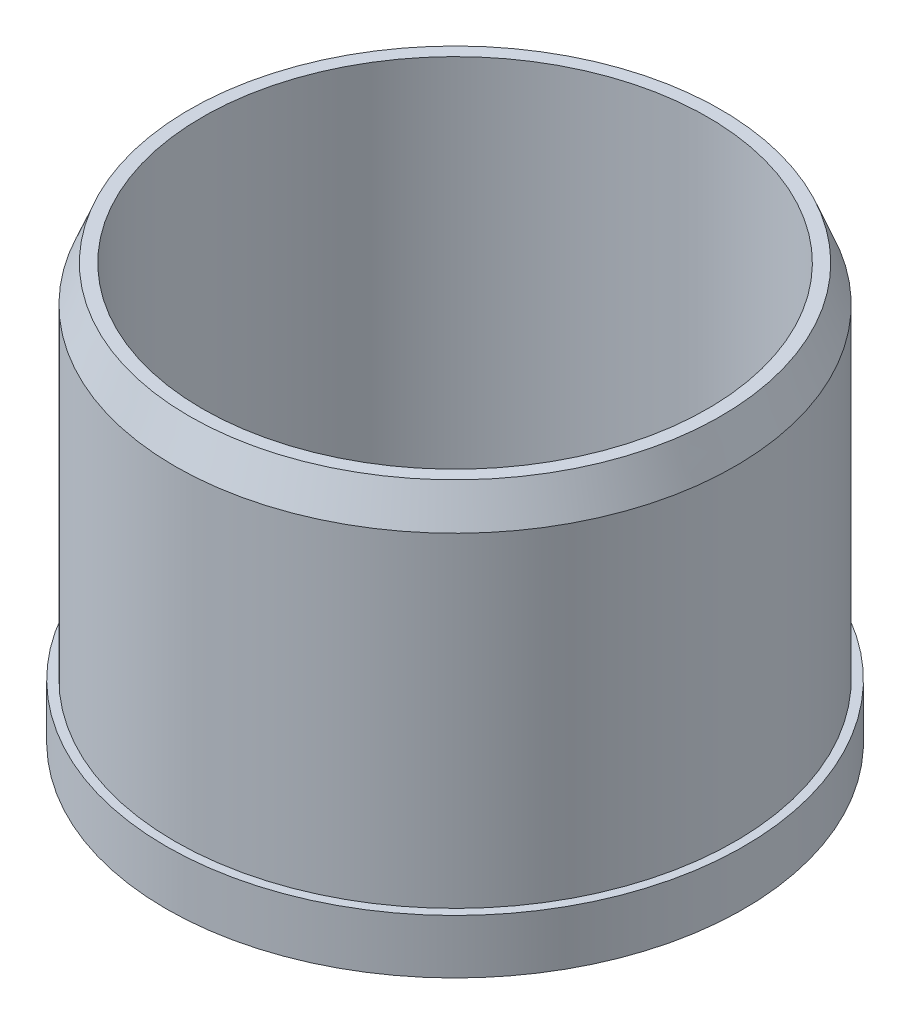
ISO-10303-21;
HEADER;
FILE_DESCRIPTION(('STEP AP214'),'2;1');
FILE_NAME('part.step','',(''),(''),'','','');
FILE_SCHEMA(('AUTOMOTIVE_DESIGN { 1 0 10303 214 1 1 1 1 }'));
ENDSEC;
DATA;
#1=APPLICATION_CONTEXT('core data for automotive mechanical design processes');
#2=APPLICATION_PROTOCOL_DEFINITION('international standard','automotive_design',2000,#1);
#3=PRODUCT_CONTEXT('',#1,'mechanical');
#4=PRODUCT('Part','Part','',(#3));
#5=PRODUCT_RELATED_PRODUCT_CATEGORY('part','',(#4));
#6=PRODUCT_DEFINITION_FORMATION('','',#4);
#7=PRODUCT_DEFINITION_CONTEXT('part definition',#1,'design');
#8=PRODUCT_DEFINITION('design','',#6,#7);
#9=PRODUCT_DEFINITION_SHAPE('','',#8);
#10=(LENGTH_UNIT() NAMED_UNIT(*) SI_UNIT(.MILLI.,.METRE.));
#11=(NAMED_UNIT(*) PLANE_ANGLE_UNIT() SI_UNIT($,.RADIAN.));
#12=(NAMED_UNIT(*) SI_UNIT($,.STERADIAN.) SOLID_ANGLE_UNIT());
#13=UNCERTAINTY_MEASURE_WITH_UNIT(LENGTH_MEASURE(1.E-05),#10,'distance_accuracy_value','');
#14=(GEOMETRIC_REPRESENTATION_CONTEXT(3) GLOBAL_UNCERTAINTY_ASSIGNED_CONTEXT((#13)) GLOBAL_UNIT_ASSIGNED_CONTEXT((#10,
#11,#12)) REPRESENTATION_CONTEXT('',''));
#15=CARTESIAN_POINT('',(0.,0.,0.));
#16=DIRECTION('',(0.,0.,1.));
#17=DIRECTION('',(1.,0.,0.));
#18=AXIS2_PLACEMENT_3D('',#15,#16,#17);
#19=CARTESIAN_POINT('',(0.,9.525,0.));
#20=DIRECTION('',(0.,1.,0.));
#21=DIRECTION('',(0.,0.,1.));
#22=AXIS2_PLACEMENT_3D('',#19,#20,#21);
#23=PLANE('',#22);
#24=CARTESIAN_POINT('',(0.,9.525,0.));
#25=DIRECTION('',(0.,1.,0.));
#26=DIRECTION('',(0.,0.,1.));
#27=AXIS2_PLACEMENT_3D('',#24,#25,#26);
#28=CIRCLE('',#27,12.7);
#29=CARTESIAN_POINT('',(0.,9.525,12.7));
#30=VERTEX_POINT('',#29);
#31=EDGE_CURVE('E107',#30,#30,#28,.T.);
#32=ORIENTED_EDGE('',*,*,#31,.F.);
#33=EDGE_LOOP('',(#32));
#34=FACE_BOUND('',#33,.T.);
#35=CARTESIAN_POINT('',(27.1764399531351,9.525,-8.83016061426567));
#36=DIRECTION('',(0.,1.,0.));
#37=DIRECTION('',(0.,0.,1.));
#38=AXIS2_PLACEMENT_3D('',#35,#36,#37);
#39=CIRCLE('',#38,12.7000000000007);
#40=CARTESIAN_POINT('',(27.1764399531351,9.525,3.86983938573504));
#41=VERTEX_POINT('',#40);
#42=EDGE_CURVE('E88',#41,#41,#39,.T.);
#43=ORIENTED_EDGE('',*,*,#42,.F.);
#44=EDGE_LOOP('',(#43));
#45=FACE_BOUND('',#44,.T.);
#46=CARTESIAN_POINT('',(16.7959635842603,9.525,23.1176606142632));
#47=DIRECTION('',(0.,1.,0.));
#48=DIRECTION('',(0.,0.,1.));
#49=AXIS2_PLACEMENT_3D('',#46,#47,#48);
#50=CIRCLE('',#49,12.7000000000027);
#51=CARTESIAN_POINT('',(16.7959635842603,9.525,35.8176606142658));
#52=VERTEX_POINT('',#51);
#53=EDGE_CURVE('E91',#52,#52,#50,.T.);
#54=ORIENTED_EDGE('',*,*,#53,.F.);
#55=EDGE_LOOP('',(#54));
#56=FACE_BOUND('',#55,.T.);
#57=CARTESIAN_POINT('',(-16.7959635842545,9.525,23.1176606142651));
#58=DIRECTION('',(0.,1.,0.));
#59=DIRECTION('',(0.,0.,1.));
#60=AXIS2_PLACEMENT_3D('',#57,#58,#59);
#61=CIRCLE('',#60,12.7000000000033);
#62=CARTESIAN_POINT('',(-16.7959635842545,9.525,35.8176606142684));
#63=VERTEX_POINT('',#62);
#64=EDGE_CURVE('E94',#63,#63,#61,.T.);
#65=ORIENTED_EDGE('',*,*,#64,.F.);
#66=EDGE_LOOP('',(#65));
#67=FACE_BOUND('',#66,.T.);
#68=CARTESIAN_POINT('',(-27.1764399531329,9.525,-8.83016061426258));
#69=DIRECTION('',(0.,1.,0.));
#70=DIRECTION('',(0.,0.,1.));
#71=AXIS2_PLACEMENT_3D('',#68,#69,#70);
#72=CIRCLE('',#71,12.7000000000018);
#73=CARTESIAN_POINT('',(-27.1764399531329,9.525,3.86983938573925));
#74=VERTEX_POINT('',#73);
#75=EDGE_CURVE('E97',#74,#74,#72,.T.);
#76=ORIENTED_EDGE('',*,*,#75,.F.);
#77=EDGE_LOOP('',(#76));
#78=FACE_BOUND('',#77,.T.);
#79=CARTESIAN_POINT('',(0.,9.525,-28.575));
#80=DIRECTION('',(0.,1.,0.));
#81=DIRECTION('',(0.,0.,1.));
#82=AXIS2_PLACEMENT_3D('',#79,#80,#81);
#83=CIRCLE('',#82,12.7);
#84=CARTESIAN_POINT('',(0.,9.525,-15.875));
#85=VERTEX_POINT('',#84);
#86=EDGE_CURVE('E65',#85,#85,#83,.T.);
#87=ORIENTED_EDGE('',*,*,#86,.F.);
#88=EDGE_LOOP('',(#87));
#89=FACE_BOUND('',#88,.T.);
#90=CARTESIAN_POINT('',(0.,9.525,0.));
#91=DIRECTION('',(0.,1.,0.));
#92=DIRECTION('',(0.,0.,1.));
#93=AXIS2_PLACEMENT_3D('',#90,#91,#92);
#94=CIRCLE('',#93,44.45);
#95=CARTESIAN_POINT('',(0.,9.525,44.45));
#96=VERTEX_POINT('',#95);
#97=EDGE_CURVE('E104',#96,#96,#94,.T.);
#98=ORIENTED_EDGE('',*,*,#97,.T.);
#99=EDGE_LOOP('',(#98));
#100=FACE_BOUND('',#99,.T.);
#101=ADVANCED_FACE('F41',(#34,#45,#56,#67,#78,#89,#100),#23,.T.);
#102=CARTESIAN_POINT('',(0.,9.525,0.));
#103=DIRECTION('',(0.,-1.,0.));
#104=DIRECTION('',(0.,0.,-1.));
#105=AXIS2_PLACEMENT_3D('',#102,#103,#104);
#106=CYLINDRICAL_SURFACE('',#105,50.8);
#107=CARTESIAN_POINT('',(0.,9.525,0.));
#108=DIRECTION('',(0.,1.,0.));
#109=DIRECTION('',(0.,0.,1.));
#110=AXIS2_PLACEMENT_3D('',#107,#108,#109);
#111=CIRCLE('',#110,50.8);
#112=CARTESIAN_POINT('',(0.,9.525,50.8));
#113=VERTEX_POINT('',#112);
#114=EDGE_CURVE('E85',#113,#113,#111,.T.);
#115=ORIENTED_EDGE('',*,*,#114,.F.);
#116=EDGE_LOOP('',(#115));
#117=FACE_BOUND('',#116,.T.);
#118=CARTESIAN_POINT('',(0.,0.,0.));
#119=DIRECTION('',(0.,1.,0.));
#120=DIRECTION('',(0.,0.,1.));
#121=AXIS2_PLACEMENT_3D('',#118,#119,#120);
#122=CIRCLE('',#121,50.8);
#123=CARTESIAN_POINT('',(0.,0.,50.8));
#124=VERTEX_POINT('',#123);
#125=EDGE_CURVE('E66',#124,#124,#122,.T.);
#126=ORIENTED_EDGE('',*,*,#125,.T.);
#127=EDGE_LOOP('',(#126));
#128=FACE_BOUND('',#127,.T.);
#129=ADVANCED_FACE('F131',(#117,#128),#106,.T.);
#130=CARTESIAN_POINT('',(27.1764399531351,9.525,-8.83016061426567));
#131=DIRECTION('',(0.,-1.,0.));
#132=DIRECTION('',(0.,0.,-1.));
#133=AXIS2_PLACEMENT_3D('',#130,#131,#132);
#134=CYLINDRICAL_SURFACE('',#133,12.7000000000007);
#135=ORIENTED_EDGE('',*,*,#42,.T.);
#136=EDGE_LOOP('',(#135));
#137=FACE_BOUND('',#136,.T.);
#138=CARTESIAN_POINT('',(27.1764399531351,0.,-8.83016061426567));
#139=DIRECTION('',(0.,1.,0.));
#140=DIRECTION('',(0.,0.,1.));
#141=AXIS2_PLACEMENT_3D('',#138,#139,#140);
#142=CIRCLE('',#141,12.7000000000007);
#143=CARTESIAN_POINT('',(27.1764399531351,0.,3.86983938573504));
#144=VERTEX_POINT('',#143);
#145=EDGE_CURVE('E69',#144,#144,#142,.T.);
#146=ORIENTED_EDGE('',*,*,#145,.F.);
#147=EDGE_LOOP('',(#146));
#148=FACE_BOUND('',#147,.T.);
#149=ADVANCED_FACE('F138',(#137,#148),#134,.F.);
#150=CARTESIAN_POINT('',(16.7959635842603,9.525,23.1176606142632));
#151=DIRECTION('',(0.,-1.,0.));
#152=DIRECTION('',(0.,0.,-1.));
#153=AXIS2_PLACEMENT_3D('',#150,#151,#152);
#154=CYLINDRICAL_SURFACE('',#153,12.7000000000027);
#155=ORIENTED_EDGE('',*,*,#53,.T.);
#156=EDGE_LOOP('',(#155));
#157=FACE_BOUND('',#156,.T.);
#158=CARTESIAN_POINT('',(16.7959635842603,0.,23.1176606142632));
#159=DIRECTION('',(0.,1.,0.));
#160=DIRECTION('',(0.,0.,1.));
#161=AXIS2_PLACEMENT_3D('',#158,#159,#160);
#162=CIRCLE('',#161,12.7000000000027);
#163=CARTESIAN_POINT('',(16.7959635842603,0.,35.8176606142658));
#164=VERTEX_POINT('',#163);
#165=EDGE_CURVE('E72',#164,#164,#162,.T.);
#166=ORIENTED_EDGE('',*,*,#165,.F.);
#167=EDGE_LOOP('',(#166));
#168=FACE_BOUND('',#167,.T.);
#169=ADVANCED_FACE('F225',(#157,#168),#154,.F.);
#170=CARTESIAN_POINT('',(-16.7959635842545,9.525,23.1176606142651));
#171=DIRECTION('',(0.,-1.,0.));
#172=DIRECTION('',(0.,0.,-1.));
#173=AXIS2_PLACEMENT_3D('',#170,#171,#172);
#174=CYLINDRICAL_SURFACE('',#173,12.7000000000033);
#175=ORIENTED_EDGE('',*,*,#64,.T.);
#176=EDGE_LOOP('',(#175));
#177=FACE_BOUND('',#176,.T.);
#178=CARTESIAN_POINT('',(-16.7959635842545,0.,23.1176606142651));
#179=DIRECTION('',(0.,1.,0.));
#180=DIRECTION('',(0.,0.,1.));
#181=AXIS2_PLACEMENT_3D('',#178,#179,#180);
#182=CIRCLE('',#181,12.7000000000033);
#183=CARTESIAN_POINT('',(-16.7959635842545,0.,35.8176606142684));
#184=VERTEX_POINT('',#183);
#185=EDGE_CURVE('E75',#184,#184,#182,.T.);
#186=ORIENTED_EDGE('',*,*,#185,.F.);
#187=EDGE_LOOP('',(#186));
#188=FACE_BOUND('',#187,.T.);
#189=ADVANCED_FACE('F217',(#177,#188),#174,.F.);
#190=CARTESIAN_POINT('',(-27.1764399531329,9.525,-8.83016061426258));
#191=DIRECTION('',(0.,-1.,0.));
#192=DIRECTION('',(0.,0.,-1.));
#193=AXIS2_PLACEMENT_3D('',#190,#191,#192);
#194=CYLINDRICAL_SURFACE('',#193,12.7000000000018);
#195=ORIENTED_EDGE('',*,*,#75,.T.);
#196=EDGE_LOOP('',(#195));
#197=FACE_BOUND('',#196,.T.);
#198=CARTESIAN_POINT('',(-27.1764399531329,0.,-8.83016061426258));
#199=DIRECTION('',(0.,1.,0.));
#200=DIRECTION('',(0.,0.,1.));
#201=AXIS2_PLACEMENT_3D('',#198,#199,#200);
#202=CIRCLE('',#201,12.7000000000018);
#203=CARTESIAN_POINT('',(-27.1764399531329,0.,3.86983938573925));
#204=VERTEX_POINT('',#203);
#205=EDGE_CURVE('E78',#204,#204,#202,.T.);
#206=ORIENTED_EDGE('',*,*,#205,.F.);
#207=EDGE_LOOP('',(#206));
#208=FACE_BOUND('',#207,.T.);
#209=ADVANCED_FACE('F208',(#197,#208),#194,.F.);
#210=CARTESIAN_POINT('',(0.,9.525,-28.575));
#211=DIRECTION('',(0.,-1.,0.));
#212=DIRECTION('',(0.,0.,-1.));
#213=AXIS2_PLACEMENT_3D('',#210,#211,#212);
#214=CYLINDRICAL_SURFACE('',#213,12.7);
#215=ORIENTED_EDGE('',*,*,#86,.T.);
#216=EDGE_LOOP('',(#215));
#217=FACE_BOUND('',#216,.T.);
#218=CARTESIAN_POINT('',(0.,0.,-28.575));
#219=DIRECTION('',(0.,1.,0.));
#220=DIRECTION('',(0.,0.,1.));
#221=AXIS2_PLACEMENT_3D('',#218,#219,#220);
#222=CIRCLE('',#221,12.7);
#223=CARTESIAN_POINT('',(0.,0.,-15.875));
#224=VERTEX_POINT('',#223);
#225=EDGE_CURVE('E81',#224,#224,#222,.T.);
#226=ORIENTED_EDGE('',*,*,#225,.F.);
#227=EDGE_LOOP('',(#226));
#228=FACE_BOUND('',#227,.T.);
#229=ADVANCED_FACE('F154',(#217,#228),#214,.F.);
#230=CARTESIAN_POINT('',(0.,9.525,0.));
#231=DIRECTION('',(0.,-1.,0.));
#232=DIRECTION('',(0.,0.,-1.));
#233=AXIS2_PLACEMENT_3D('',#230,#231,#232);
#234=CYLINDRICAL_SURFACE('',#233,6.5024);
#235=CARTESIAN_POINT('',(0.,0.,0.));
#236=DIRECTION('',(0.,1.,0.));
#237=DIRECTION('',(0.,0.,1.));
#238=AXIS2_PLACEMENT_3D('',#235,#236,#237);
#239=CIRCLE('',#238,6.5024);
#240=CARTESIAN_POINT('',(0.,0.,6.5024));
#241=VERTEX_POINT('',#240);
#242=EDGE_CURVE('E62',#241,#241,#239,.T.);
#243=ORIENTED_EDGE('',*,*,#242,.F.);
#244=EDGE_LOOP('',(#243));
#245=FACE_BOUND('',#244,.T.);
#246=CARTESIAN_POINT('',(0.,31.75,0.));
#247=DIRECTION('',(0.,1.,0.));
#248=DIRECTION('',(0.,0.,1.));
#249=AXIS2_PLACEMENT_3D('',#246,#247,#248);
#250=CIRCLE('',#249,6.5024);
#251=CARTESIAN_POINT('',(0.,31.75,6.5024));
#252=VERTEX_POINT('',#251);
#253=EDGE_CURVE('E112',#252,#252,#250,.T.);
#254=ORIENTED_EDGE('',*,*,#253,.T.);
#255=EDGE_LOOP('',(#254));
#256=FACE_BOUND('',#255,.T.);
#257=ADVANCED_FACE('F116',(#245,#256),#234,.F.);
#258=CARTESIAN_POINT('',(0.,9.525,0.));
#259=DIRECTION('',(0.,1.,0.));
#260=DIRECTION('',(0.,0.,1.));
#261=AXIS2_PLACEMENT_3D('',#258,#259,#260);
#262=CIRCLE('',#261,49.276);
#263=CARTESIAN_POINT('',(0.,9.525,49.276));
#264=VERTEX_POINT('',#263);
#265=EDGE_CURVE('E61',#264,#264,#262,.T.);
#266=ORIENTED_EDGE('',*,*,#265,.F.);
#267=EDGE_LOOP('',(#266));
#268=FACE_BOUND('',#267,.T.);
#269=ORIENTED_EDGE('',*,*,#114,.T.);
#270=EDGE_LOOP('',(#269));
#271=FACE_BOUND('',#270,.T.);
#272=ADVANCED_FACE('F134',(#268,#271),#23,.T.);
#273=CARTESIAN_POINT('',(0.,0.,0.));
#274=DIRECTION('',(0.,1.,0.));
#275=DIRECTION('',(0.,0.,1.));
#276=AXIS2_PLACEMENT_3D('',#273,#274,#275);
#277=PLANE('',#276);
#278=ORIENTED_EDGE('',*,*,#225,.T.);
#279=EDGE_LOOP('',(#278));
#280=FACE_BOUND('',#279,.T.);
#281=ORIENTED_EDGE('',*,*,#205,.T.);
#282=EDGE_LOOP('',(#281));
#283=FACE_BOUND('',#282,.T.);
#284=ORIENTED_EDGE('',*,*,#185,.T.);
#285=EDGE_LOOP('',(#284));
#286=FACE_BOUND('',#285,.T.);
#287=ORIENTED_EDGE('',*,*,#165,.T.);
#288=EDGE_LOOP('',(#287));
#289=FACE_BOUND('',#288,.T.);
#290=ORIENTED_EDGE('',*,*,#145,.T.);
#291=EDGE_LOOP('',(#290));
#292=FACE_BOUND('',#291,.T.);
#293=ORIENTED_EDGE('',*,*,#125,.F.);
#294=EDGE_LOOP('',(#293));
#295=FACE_BOUND('',#294,.T.);
#296=ORIENTED_EDGE('',*,*,#242,.T.);
#297=EDGE_LOOP('',(#296));
#298=FACE_BOUND('',#297,.T.);
#299=ADVANCED_FACE('F146',(#280,#283,#286,#289,#292,#295,#298),#277,.F.);
#300=CARTESIAN_POINT('',(0.,73.025,0.));
#301=DIRECTION('',(0.,1.,0.));
#302=DIRECTION('',(0.,0.,1.));
#303=AXIS2_PLACEMENT_3D('',#300,#301,#302);
#304=PLANE('',#303);
#305=CARTESIAN_POINT('',(0.,73.025,0.));
#306=DIRECTION('',(0.,1.,0.));
#307=DIRECTION('',(0.,0.,1.));
#308=AXIS2_PLACEMENT_3D('',#305,#306,#307);
#309=CIRCLE('',#308,46.736);
#310=CARTESIAN_POINT('',(0.,73.025,46.736));
#311=VERTEX_POINT('',#310);
#312=EDGE_CURVE('E56',#311,#311,#309,.T.);
#313=ORIENTED_EDGE('',*,*,#312,.T.);
#314=EDGE_LOOP('',(#313));
#315=FACE_BOUND('',#314,.T.);
#316=CARTESIAN_POINT('',(0.,73.025,0.));
#317=DIRECTION('',(0.,1.,0.));
#318=DIRECTION('',(0.,0.,1.));
#319=AXIS2_PLACEMENT_3D('',#316,#317,#318);
#320=CIRCLE('',#319,44.45);
#321=CARTESIAN_POINT('',(0.,73.025,44.45));
#322=VERTEX_POINT('',#321);
#323=EDGE_CURVE('E84',#322,#322,#320,.T.);
#324=ORIENTED_EDGE('',*,*,#323,.F.);
#325=EDGE_LOOP('',(#324));
#326=FACE_BOUND('',#325,.T.);
#327=ADVANCED_FACE('F152',(#315,#326),#304,.T.);
#328=CARTESIAN_POINT('',(0.,73.025,0.));
#329=DIRECTION('',(0.,-1.,0.));
#330=DIRECTION('',(0.,0.,-1.));
#331=AXIS2_PLACEMENT_3D('',#328,#329,#330);
#332=CYLINDRICAL_SURFACE('',#331,49.276);
#333=CARTESIAN_POINT('',(0.,66.675,0.));
#334=DIRECTION('',(0.,1.,0.));
#335=DIRECTION('',(0.,0.,1.));
#336=AXIS2_PLACEMENT_3D('',#333,#334,#335);
#337=CIRCLE('',#336,49.276);
#338=CARTESIAN_POINT('',(0.,66.675,49.276));
#339=VERTEX_POINT('',#338);
#340=EDGE_CURVE('E52',#339,#339,#337,.F.);
#341=ORIENTED_EDGE('',*,*,#340,.T.);
#342=EDGE_LOOP('',(#341));
#343=FACE_BOUND('',#342,.T.);
#344=ORIENTED_EDGE('',*,*,#265,.T.);
#345=EDGE_LOOP('',(#344));
#346=FACE_BOUND('',#345,.T.);
#347=ADVANCED_FACE('F166',(#343,#346),#332,.T.);
#348=CARTESIAN_POINT('',(0.,73.025,0.));
#349=DIRECTION('',(0.,-1.,0.));
#350=DIRECTION('',(0.,0.,-1.));
#351=AXIS2_PLACEMENT_3D('',#348,#349,#350);
#352=CYLINDRICAL_SURFACE('',#351,44.45);
#353=ORIENTED_EDGE('',*,*,#323,.T.);
#354=EDGE_LOOP('',(#353));
#355=FACE_BOUND('',#354,.T.);
#356=ORIENTED_EDGE('',*,*,#97,.F.);
#357=EDGE_LOOP('',(#356));
#358=FACE_BOUND('',#357,.T.);
#359=ADVANCED_FACE('F168',(#355,#358),#352,.F.);
#360=CARTESIAN_POINT('',(0.,25.4,0.));
#361=DIRECTION('',(0.,-1.,0.));
#362=DIRECTION('',(0.,0.,-1.));
#363=AXIS2_PLACEMENT_3D('',#360,#361,#362);
#364=CYLINDRICAL_SURFACE('',#363,12.7);
#365=CARTESIAN_POINT('',(0.,29.21,0.));
#366=DIRECTION('',(0.,1.,0.));
#367=DIRECTION('',(0.,0.,1.));
#368=AXIS2_PLACEMENT_3D('',#365,#366,#367);
#369=CIRCLE('',#368,12.7);
#370=CARTESIAN_POINT('',(0.,29.21,12.7));
#371=VERTEX_POINT('',#370);
#372=EDGE_CURVE('E10',#371,#371,#369,.F.);
#373=ORIENTED_EDGE('',*,*,#372,.T.);
#374=EDGE_LOOP('',(#373));
#375=FACE_BOUND('',#374,.T.);
#376=ORIENTED_EDGE('',*,*,#31,.T.);
#377=EDGE_LOOP('',(#376));
#378=FACE_BOUND('',#377,.T.);
#379=ADVANCED_FACE('F127',(#375,#378),#364,.T.);
#380=CARTESIAN_POINT('',(0.,73.025,0.));
#381=DIRECTION('',(0.,-1.,0.));
#382=DIRECTION('',(0.,0.,-1.));
#383=AXIS2_PLACEMENT_3D('',#380,#381,#382);
#384=CONICAL_SURFACE('',#383,46.736,0.380506377112363);
#385=ORIENTED_EDGE('',*,*,#340,.F.);
#386=EDGE_LOOP('',(#385));
#387=FACE_BOUND('',#386,.T.);
#388=ORIENTED_EDGE('',*,*,#312,.F.);
#389=EDGE_LOOP('',(#388));
#390=FACE_BOUND('',#389,.T.);
#391=ADVANCED_FACE('F120',(#387,#390),#384,.T.);
#392=CARTESIAN_POINT('',(0.,31.75,0.));
#393=DIRECTION('',(0.,1.,0.));
#394=DIRECTION('',(0.,0.,1.));
#395=AXIS2_PLACEMENT_3D('',#392,#393,#394);
#396=PLANE('',#395);
#397=CARTESIAN_POINT('',(0.,31.75,0.));
#398=DIRECTION('',(0.,1.,0.));
#399=DIRECTION('',(0.,0.,1.));
#400=AXIS2_PLACEMENT_3D('',#397,#398,#399);
#401=CIRCLE('',#400,10.16);
#402=CARTESIAN_POINT('',(0.,31.75,10.16));
#403=VERTEX_POINT('',#402);
#404=EDGE_CURVE('E48',#403,#403,#401,.T.);
#405=ORIENTED_EDGE('',*,*,#404,.T.);
#406=EDGE_LOOP('',(#405));
#407=FACE_BOUND('',#406,.T.);
#408=ORIENTED_EDGE('',*,*,#253,.F.);
#409=EDGE_LOOP('',(#408));
#410=FACE_BOUND('',#409,.T.);
#411=ADVANCED_FACE('F118',(#407,#410),#396,.T.);
#412=CARTESIAN_POINT('',(0.,29.21,0.));
#413=DIRECTION('',(0.,1.,0.));
#414=DIRECTION('',(0.,0.,1.));
#415=AXIS2_PLACEMENT_3D('',#412,#413,#414);
#416=TOROIDAL_SURFACE('',#415,10.16,2.54);
#417=ORIENTED_EDGE('',*,*,#372,.F.);
#418=EDGE_LOOP('',(#417));
#419=FACE_BOUND('',#418,.T.);
#420=ORIENTED_EDGE('',*,*,#404,.F.);
#421=EDGE_LOOP('',(#420));
#422=FACE_BOUND('',#421,.T.);
#423=ADVANCED_FACE('F43',(#419,#422),#416,.T.);
#424=CLOSED_SHELL('',(#101,#129,#149,#169,#189,#209,#229,#257,#272,#299,#327,#347,#359,#379,
#391,#411,#423));
#425=MANIFOLD_SOLID_BREP('B2',#424);
#426=ADVANCED_BREP_SHAPE_REPRESENTATION('',(#18,#425),#14);
#427=SHAPE_DEFINITION_REPRESENTATION(#9,#426);
ENDSEC;
END-ISO-10303-21;
